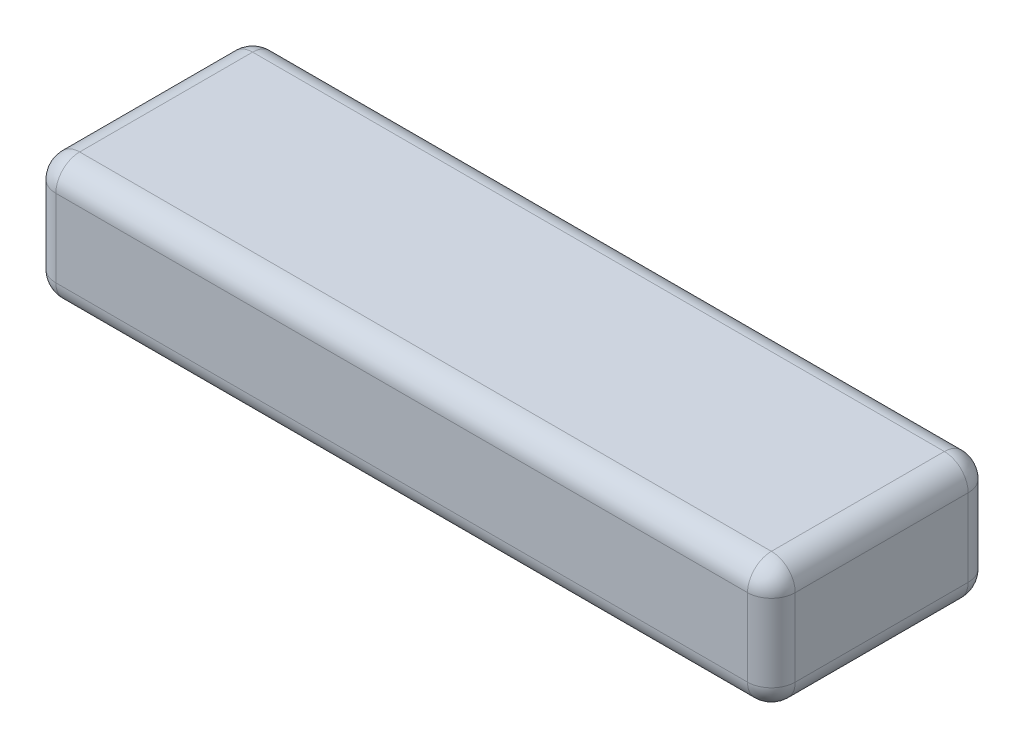
ISO-10303-21;
HEADER;
FILE_DESCRIPTION(('STEP AP214'),'2;1');
FILE_NAME('part.step','',(''),(''),'','','');
FILE_SCHEMA(('AUTOMOTIVE_DESIGN { 1 0 10303 214 1 1 1 1 }'));
ENDSEC;
DATA;
#1=APPLICATION_CONTEXT('core data for automotive mechanical design processes');
#2=APPLICATION_PROTOCOL_DEFINITION('international standard','automotive_design',2000,#1);
#3=PRODUCT_CONTEXT('',#1,'mechanical');
#4=PRODUCT('Part','Part','',(#3));
#5=PRODUCT_RELATED_PRODUCT_CATEGORY('part','',(#4));
#6=PRODUCT_DEFINITION_FORMATION('','',#4);
#7=PRODUCT_DEFINITION_CONTEXT('part definition',#1,'design');
#8=PRODUCT_DEFINITION('design','',#6,#7);
#9=PRODUCT_DEFINITION_SHAPE('','',#8);
#10=(LENGTH_UNIT() NAMED_UNIT(*) SI_UNIT(.MILLI.,.METRE.));
#11=(NAMED_UNIT(*) PLANE_ANGLE_UNIT() SI_UNIT($,.RADIAN.));
#12=(NAMED_UNIT(*) SI_UNIT($,.STERADIAN.) SOLID_ANGLE_UNIT());
#13=UNCERTAINTY_MEASURE_WITH_UNIT(LENGTH_MEASURE(1.E-05),#10,'distance_accuracy_value','');
#14=(GEOMETRIC_REPRESENTATION_CONTEXT(3) GLOBAL_UNCERTAINTY_ASSIGNED_CONTEXT((#13)) GLOBAL_UNIT_ASSIGNED_CONTEXT((#10,
#11,#12)) REPRESENTATION_CONTEXT('',''));
#15=CARTESIAN_POINT('',(0.,0.,0.));
#16=DIRECTION('',(0.,0.,1.));
#17=DIRECTION('',(1.,0.,0.));
#18=AXIS2_PLACEMENT_3D('',#15,#16,#17);
#19=CARTESIAN_POINT('',(31.,5.25,-9.25));
#20=DIRECTION('',(-1.,0.,0.));
#21=DIRECTION('',(0.,0.,1.));
#22=AXIS2_PLACEMENT_3D('',#19,#20,#21);
#23=PLANE('',#22);
#24=DIRECTION('',(0.,0.,-1.));
#25=VECTOR('',#24,1.);
#26=CARTESIAN_POINT('',(31.,-3.25,-9.25));
#27=LINE('',#26,#25);
#28=CARTESIAN_POINT('',(31.,-3.25,7.25));
#29=VERTEX_POINT('',#28);
#30=CARTESIAN_POINT('',(31.,-3.25,-7.25));
#31=VERTEX_POINT('',#30);
#32=EDGE_CURVE('E212',#29,#31,#27,.T.);
#33=ORIENTED_EDGE('',*,*,#32,.T.);
#34=DIRECTION('',(0.,-1.,0.));
#35=VECTOR('',#34,1.);
#36=CARTESIAN_POINT('',(31.,5.25,-7.25));
#37=LINE('',#36,#35);
#38=CARTESIAN_POINT('',(31.,3.25,-7.25));
#39=VERTEX_POINT('',#38);
#40=EDGE_CURVE('E216',#31,#39,#37,.F.);
#41=ORIENTED_EDGE('',*,*,#40,.T.);
#42=DIRECTION('',(0.,0.,-1.));
#43=VECTOR('',#42,1.);
#44=CARTESIAN_POINT('',(31.,3.25,9.25));
#45=LINE('',#44,#43);
#46=CARTESIAN_POINT('',(31.,3.25,7.25));
#47=VERTEX_POINT('',#46);
#48=EDGE_CURVE('E209',#39,#47,#45,.F.);
#49=ORIENTED_EDGE('',*,*,#48,.T.);
#50=DIRECTION('',(0.,-1.,0.));
#51=VECTOR('',#50,1.);
#52=CARTESIAN_POINT('',(31.,5.25,7.25));
#53=LINE('',#52,#51);
#54=EDGE_CURVE('E206',#47,#29,#53,.T.);
#55=ORIENTED_EDGE('',*,*,#54,.T.);
#56=EDGE_LOOP('',(#33,#41,#49,#55));
#57=FACE_BOUND('',#56,.T.);
#58=ADVANCED_FACE('F41',(#57),#23,.F.);
#59=CARTESIAN_POINT('',(-31.,5.25,-9.25));
#60=DIRECTION('',(0.,0.,1.));
#61=DIRECTION('',(1.,0.,0.));
#62=AXIS2_PLACEMENT_3D('',#59,#60,#61);
#63=PLANE('',#62);
#64=DIRECTION('',(-1.,0.,0.));
#65=VECTOR('',#64,1.);
#66=CARTESIAN_POINT('',(-31.,-3.25,-9.25));
#67=LINE('',#66,#65);
#68=CARTESIAN_POINT('',(29.,-3.25,-9.25));
#69=VERTEX_POINT('',#68);
#70=CARTESIAN_POINT('',(-29.,-3.25,-9.25));
#71=VERTEX_POINT('',#70);
#72=EDGE_CURVE('E143',#69,#71,#67,.T.);
#73=ORIENTED_EDGE('',*,*,#72,.T.);
#74=DIRECTION('',(0.,-1.,0.));
#75=VECTOR('',#74,1.);
#76=CARTESIAN_POINT('',(-29.,5.25,-9.25));
#77=LINE('',#76,#75);
#78=CARTESIAN_POINT('',(-29.,3.25,-9.25));
#79=VERTEX_POINT('',#78);
#80=EDGE_CURVE('E138',#71,#79,#77,.F.);
#81=ORIENTED_EDGE('',*,*,#80,.T.);
#82=DIRECTION('',(-1.,0.,0.));
#83=VECTOR('',#82,1.);
#84=CARTESIAN_POINT('',(31.,3.25,-9.25));
#85=LINE('',#84,#83);
#86=CARTESIAN_POINT('',(29.,3.25,-9.25));
#87=VERTEX_POINT('',#86);
#88=EDGE_CURVE('E130',#79,#87,#85,.F.);
#89=ORIENTED_EDGE('',*,*,#88,.T.);
#90=DIRECTION('',(0.,-1.,0.));
#91=VECTOR('',#90,1.);
#92=CARTESIAN_POINT('',(29.,5.25,-9.25));
#93=LINE('',#92,#91);
#94=EDGE_CURVE('E135',#87,#69,#93,.T.);
#95=ORIENTED_EDGE('',*,*,#94,.T.);
#96=EDGE_LOOP('',(#73,#81,#89,#95));
#97=FACE_BOUND('',#96,.T.);
#98=ADVANCED_FACE('F133',(#97),#63,.F.);
#99=CARTESIAN_POINT('',(-31.,5.25,-9.25));
#100=DIRECTION('',(1.,0.,0.));
#101=DIRECTION('',(0.,0.,-1.));
#102=AXIS2_PLACEMENT_3D('',#99,#100,#101);
#103=PLANE('',#102);
#104=DIRECTION('',(0.,0.,1.));
#105=VECTOR('',#104,1.);
#106=CARTESIAN_POINT('',(-31.,3.25,-9.25));
#107=LINE('',#106,#105);
#108=CARTESIAN_POINT('',(-31.,3.25,7.25));
#109=VERTEX_POINT('',#108);
#110=CARTESIAN_POINT('',(-31.,3.25,-7.25));
#111=VERTEX_POINT('',#110);
#112=EDGE_CURVE('E51',#109,#111,#107,.F.);
#113=ORIENTED_EDGE('',*,*,#112,.T.);
#114=DIRECTION('',(0.,-1.,0.));
#115=VECTOR('',#114,1.);
#116=CARTESIAN_POINT('',(-31.,5.25,-7.25));
#117=LINE('',#116,#115);
#118=CARTESIAN_POINT('',(-31.,-3.25,-7.25));
#119=VERTEX_POINT('',#118);
#120=EDGE_CURVE('E11',#111,#119,#117,.T.);
#121=ORIENTED_EDGE('',*,*,#120,.T.);
#122=DIRECTION('',(0.,0.,1.));
#123=VECTOR('',#122,1.);
#124=CARTESIAN_POINT('',(-31.,-3.25,-9.25));
#125=LINE('',#124,#123);
#126=CARTESIAN_POINT('',(-31.,-3.25,7.25));
#127=VERTEX_POINT('',#126);
#128=EDGE_CURVE('E231',#119,#127,#125,.T.);
#129=ORIENTED_EDGE('',*,*,#128,.T.);
#130=DIRECTION('',(0.,-1.,0.));
#131=VECTOR('',#130,1.);
#132=CARTESIAN_POINT('',(-31.,5.25,7.25));
#133=LINE('',#132,#131);
#134=EDGE_CURVE('E62',#127,#109,#133,.F.);
#135=ORIENTED_EDGE('',*,*,#134,.T.);
#136=EDGE_LOOP('',(#113,#121,#129,#135));
#137=FACE_BOUND('',#136,.T.);
#138=ADVANCED_FACE('F326',(#137),#103,.F.);
#139=CARTESIAN_POINT('',(-31.,5.25,9.25));
#140=DIRECTION('',(0.,0.,-1.));
#141=DIRECTION('',(-1.,0.,0.));
#142=AXIS2_PLACEMENT_3D('',#139,#140,#141);
#143=PLANE('',#142);
#144=DIRECTION('',(1.,0.,0.));
#145=VECTOR('',#144,1.);
#146=CARTESIAN_POINT('',(-31.,3.25,9.25));
#147=LINE('',#146,#145);
#148=CARTESIAN_POINT('',(29.,3.25,9.25));
#149=VERTEX_POINT('',#148);
#150=CARTESIAN_POINT('',(-29.,3.25,9.25));
#151=VERTEX_POINT('',#150);
#152=EDGE_CURVE('E196',#149,#151,#147,.F.);
#153=ORIENTED_EDGE('',*,*,#152,.T.);
#154=DIRECTION('',(0.,-1.,0.));
#155=VECTOR('',#154,1.);
#156=CARTESIAN_POINT('',(-29.,5.25,9.25));
#157=LINE('',#156,#155);
#158=CARTESIAN_POINT('',(-29.,-3.25,9.25));
#159=VERTEX_POINT('',#158);
#160=EDGE_CURVE('E203',#151,#159,#157,.T.);
#161=ORIENTED_EDGE('',*,*,#160,.T.);
#162=DIRECTION('',(1.,0.,0.));
#163=VECTOR('',#162,1.);
#164=CARTESIAN_POINT('',(-31.,-3.25,9.25));
#165=LINE('',#164,#163);
#166=CARTESIAN_POINT('',(29.,-3.25,9.25));
#167=VERTEX_POINT('',#166);
#168=EDGE_CURVE('E199',#159,#167,#165,.T.);
#169=ORIENTED_EDGE('',*,*,#168,.T.);
#170=DIRECTION('',(0.,-1.,0.));
#171=VECTOR('',#170,1.);
#172=CARTESIAN_POINT('',(29.,5.25,9.25));
#173=LINE('',#172,#171);
#174=EDGE_CURVE('E193',#167,#149,#173,.F.);
#175=ORIENTED_EDGE('',*,*,#174,.T.);
#176=EDGE_LOOP('',(#153,#161,#169,#175));
#177=FACE_BOUND('',#176,.T.);
#178=ADVANCED_FACE('F349',(#177),#143,.F.);
#179=CARTESIAN_POINT('',(0.,5.25,0.));
#180=DIRECTION('',(0.,1.,0.));
#181=DIRECTION('',(0.,0.,1.));
#182=AXIS2_PLACEMENT_3D('',#179,#180,#181);
#183=PLANE('',#182);
#184=DIRECTION('',(1.,0.,0.));
#185=VECTOR('',#184,1.);
#186=CARTESIAN_POINT('',(31.,5.25,7.25));
#187=LINE('',#186,#185);
#188=CARTESIAN_POINT('',(-29.,5.25,7.25));
#189=VERTEX_POINT('',#188);
#190=CARTESIAN_POINT('',(29.,5.25,7.25));
#191=VERTEX_POINT('',#190);
#192=EDGE_CURVE('E224',#189,#191,#187,.T.);
#193=ORIENTED_EDGE('',*,*,#192,.T.);
#194=DIRECTION('',(0.,0.,-1.));
#195=VECTOR('',#194,1.);
#196=CARTESIAN_POINT('',(29.,5.25,-9.25));
#197=LINE('',#196,#195);
#198=CARTESIAN_POINT('',(29.,5.25,-7.25));
#199=VERTEX_POINT('',#198);
#200=EDGE_CURVE('E228',#191,#199,#197,.T.);
#201=ORIENTED_EDGE('',*,*,#200,.T.);
#202=DIRECTION('',(-1.,0.,0.));
#203=VECTOR('',#202,1.);
#204=CARTESIAN_POINT('',(-31.,5.25,-7.25));
#205=LINE('',#204,#203);
#206=CARTESIAN_POINT('',(-29.,5.25,-7.25));
#207=VERTEX_POINT('',#206);
#208=EDGE_CURVE('E150',#199,#207,#205,.T.);
#209=ORIENTED_EDGE('',*,*,#208,.T.);
#210=DIRECTION('',(0.,0.,1.));
#211=VECTOR('',#210,1.);
#212=CARTESIAN_POINT('',(-29.,5.25,9.25));
#213=LINE('',#212,#211);
#214=EDGE_CURVE('E219',#207,#189,#213,.T.);
#215=ORIENTED_EDGE('',*,*,#214,.T.);
#216=EDGE_LOOP('',(#193,#201,#209,#215));
#217=FACE_BOUND('',#216,.T.);
#218=ADVANCED_FACE('F366',(#217),#183,.T.);
#219=CARTESIAN_POINT('',(0.,-5.25,0.));
#220=DIRECTION('',(0.,1.,0.));
#221=DIRECTION('',(0.,0.,1.));
#222=AXIS2_PLACEMENT_3D('',#219,#220,#221);
#223=PLANE('',#222);
#224=DIRECTION('',(-1.,0.,0.));
#225=VECTOR('',#224,1.);
#226=CARTESIAN_POINT('',(0.,-5.25,-7.25));
#227=LINE('',#226,#225);
#228=CARTESIAN_POINT('',(-29.,-5.25,-7.25));
#229=VERTEX_POINT('',#228);
#230=CARTESIAN_POINT('',(29.,-5.25,-7.25));
#231=VERTEX_POINT('',#230);
#232=EDGE_CURVE('E186',#229,#231,#227,.F.);
#233=ORIENTED_EDGE('',*,*,#232,.T.);
#234=DIRECTION('',(0.,0.,-1.));
#235=VECTOR('',#234,1.);
#236=CARTESIAN_POINT('',(29.,-5.25,0.));
#237=LINE('',#236,#235);
#238=CARTESIAN_POINT('',(29.,-5.25,7.25));
#239=VERTEX_POINT('',#238);
#240=EDGE_CURVE('E190',#231,#239,#237,.F.);
#241=ORIENTED_EDGE('',*,*,#240,.T.);
#242=DIRECTION('',(1.,0.,0.));
#243=VECTOR('',#242,1.);
#244=CARTESIAN_POINT('',(0.,-5.25,7.25));
#245=LINE('',#244,#243);
#246=CARTESIAN_POINT('',(-29.,-5.25,7.25));
#247=VERTEX_POINT('',#246);
#248=EDGE_CURVE('E183',#239,#247,#245,.F.);
#249=ORIENTED_EDGE('',*,*,#248,.T.);
#250=DIRECTION('',(0.,0.,1.));
#251=VECTOR('',#250,1.);
#252=CARTESIAN_POINT('',(-29.,-5.25,0.));
#253=LINE('',#252,#251);
#254=EDGE_CURVE('E180',#247,#229,#253,.F.);
#255=ORIENTED_EDGE('',*,*,#254,.T.);
#256=EDGE_LOOP('',(#233,#241,#249,#255));
#257=FACE_BOUND('',#256,.T.);
#258=ADVANCED_FACE('F340',(#257),#223,.F.);
#259=CARTESIAN_POINT('',(0.,3.25,7.25));
#260=DIRECTION('',(-1.,0.,0.));
#261=DIRECTION('',(0.,0.,1.));
#262=AXIS2_PLACEMENT_3D('',#259,#260,#261);
#263=CYLINDRICAL_SURFACE('',#262,2.);
#264=CARTESIAN_POINT('',(29.,3.25,7.25));
#265=DIRECTION('',(1.,0.,0.));
#266=DIRECTION('',(0.,0.,-1.));
#267=AXIS2_PLACEMENT_3D('',#264,#265,#266);
#268=CIRCLE('',#267,2.);
#269=EDGE_CURVE('E45',#191,#149,#268,.T.);
#270=ORIENTED_EDGE('',*,*,#269,.F.);
#271=ORIENTED_EDGE('',*,*,#192,.F.);
#272=CARTESIAN_POINT('',(-29.,3.25,7.25));
#273=DIRECTION('',(-1.,0.,0.));
#274=DIRECTION('',(0.,0.,1.));
#275=AXIS2_PLACEMENT_3D('',#272,#273,#274);
#276=CIRCLE('',#275,2.);
#277=EDGE_CURVE('E174',#151,#189,#276,.T.);
#278=ORIENTED_EDGE('',*,*,#277,.F.);
#279=ORIENTED_EDGE('',*,*,#152,.F.);
#280=EDGE_LOOP('',(#270,#271,#278,#279));
#281=FACE_BOUND('',#280,.T.);
#282=ADVANCED_FACE('F43',(#281),#263,.T.);
#283=CARTESIAN_POINT('',(29.,3.25,7.25));
#284=DIRECTION('',(0.,0.,1.));
#285=DIRECTION('',(1.,0.,0.));
#286=AXIS2_PLACEMENT_3D('',#283,#284,#285);
#287=SPHERICAL_SURFACE('',#286,2.);
#288=CARTESIAN_POINT('',(29.,3.25,7.25));
#289=DIRECTION('',(0.,0.,1.));
#290=DIRECTION('',(0.,-1.,0.));
#291=AXIS2_PLACEMENT_3D('',#288,#289,#290);
#292=CIRCLE('',#291,2.);
#293=EDGE_CURVE('E297',#191,#47,#292,.F.);
#294=ORIENTED_EDGE('',*,*,#293,.F.);
#295=ORIENTED_EDGE('',*,*,#269,.T.);
#296=CARTESIAN_POINT('',(29.,3.25,7.25));
#297=DIRECTION('',(0.,1.,0.));
#298=DIRECTION('',(0.,0.,1.));
#299=AXIS2_PLACEMENT_3D('',#296,#297,#298);
#300=CIRCLE('',#299,2.);
#301=EDGE_CURVE('E301',#47,#149,#300,.F.);
#302=ORIENTED_EDGE('',*,*,#301,.F.);
#303=EDGE_LOOP('',(#294,#295,#302));
#304=FACE_BOUND('',#303,.T.);
#305=ADVANCED_FACE('F354',(#304),#287,.T.);
#306=CARTESIAN_POINT('',(-29.,3.25,7.25));
#307=DIRECTION('',(0.,0.,1.));
#308=DIRECTION('',(1.,0.,0.));
#309=AXIS2_PLACEMENT_3D('',#306,#307,#308);
#310=SPHERICAL_SURFACE('',#309,2.);
#311=CARTESIAN_POINT('',(-29.,3.25,7.25));
#312=DIRECTION('',(0.,1.,0.));
#313=DIRECTION('',(0.,0.,1.));
#314=AXIS2_PLACEMENT_3D('',#311,#312,#313);
#315=CIRCLE('',#314,2.);
#316=EDGE_CURVE('E290',#151,#109,#315,.F.);
#317=ORIENTED_EDGE('',*,*,#316,.F.);
#318=ORIENTED_EDGE('',*,*,#277,.T.);
#319=CARTESIAN_POINT('',(-29.,3.25,7.25));
#320=DIRECTION('',(0.,0.,1.));
#321=DIRECTION('',(1.,0.,0.));
#322=AXIS2_PLACEMENT_3D('',#319,#320,#321);
#323=CIRCLE('',#322,2.);
#324=EDGE_CURVE('E293',#109,#189,#323,.F.);
#325=ORIENTED_EDGE('',*,*,#324,.F.);
#326=EDGE_LOOP('',(#317,#318,#325));
#327=FACE_BOUND('',#326,.T.);
#328=ADVANCED_FACE('F310',(#327),#310,.T.);
#329=CARTESIAN_POINT('',(29.,5.25,7.25));
#330=DIRECTION('',(0.,-1.,0.));
#331=DIRECTION('',(0.,0.,-1.));
#332=AXIS2_PLACEMENT_3D('',#329,#330,#331);
#333=CYLINDRICAL_SURFACE('',#332,2.);
#334=ORIENTED_EDGE('',*,*,#301,.T.);
#335=ORIENTED_EDGE('',*,*,#174,.F.);
#336=CARTESIAN_POINT('',(29.,-3.25,7.25));
#337=DIRECTION('',(0.,-1.,0.));
#338=DIRECTION('',(0.,0.,-1.));
#339=AXIS2_PLACEMENT_3D('',#336,#337,#338);
#340=CIRCLE('',#339,2.);
#341=EDGE_CURVE('E283',#29,#167,#340,.T.);
#342=ORIENTED_EDGE('',*,*,#341,.F.);
#343=ORIENTED_EDGE('',*,*,#54,.F.);
#344=EDGE_LOOP('',(#334,#335,#342,#343));
#345=FACE_BOUND('',#344,.T.);
#346=ADVANCED_FACE('F357',(#345),#333,.T.);
#347=CARTESIAN_POINT('',(29.,3.25,0.));
#348=DIRECTION('',(0.,0.,1.));
#349=DIRECTION('',(1.,0.,0.));
#350=AXIS2_PLACEMENT_3D('',#347,#348,#349);
#351=CYLINDRICAL_SURFACE('',#350,2.);
#352=ORIENTED_EDGE('',*,*,#293,.T.);
#353=ORIENTED_EDGE('',*,*,#48,.F.);
#354=CARTESIAN_POINT('',(29.,3.25,-7.25));
#355=DIRECTION('',(0.,0.,-1.));
#356=DIRECTION('',(-1.,0.,0.));
#357=AXIS2_PLACEMENT_3D('',#354,#355,#356);
#358=CIRCLE('',#357,2.);
#359=EDGE_CURVE('E155',#199,#39,#358,.T.);
#360=ORIENTED_EDGE('',*,*,#359,.F.);
#361=ORIENTED_EDGE('',*,*,#200,.F.);
#362=EDGE_LOOP('',(#352,#353,#360,#361));
#363=FACE_BOUND('',#362,.T.);
#364=ADVANCED_FACE('F364',(#363),#351,.T.);
#365=CARTESIAN_POINT('',(0.,3.25,-7.25));
#366=DIRECTION('',(1.,0.,0.));
#367=DIRECTION('',(0.,0.,-1.));
#368=AXIS2_PLACEMENT_3D('',#365,#366,#367);
#369=CYLINDRICAL_SURFACE('',#368,2.);
#370=CARTESIAN_POINT('',(-29.,3.25,-7.25));
#371=DIRECTION('',(-1.,0.,0.));
#372=DIRECTION('',(0.,0.,1.));
#373=AXIS2_PLACEMENT_3D('',#370,#371,#372);
#374=CIRCLE('',#373,2.);
#375=EDGE_CURVE('E156',#207,#79,#374,.T.);
#376=ORIENTED_EDGE('',*,*,#375,.F.);
#377=ORIENTED_EDGE('',*,*,#208,.F.);
#378=CARTESIAN_POINT('',(29.,3.25,-7.25));
#379=DIRECTION('',(1.,0.,0.));
#380=DIRECTION('',(0.,0.,-1.));
#381=AXIS2_PLACEMENT_3D('',#378,#379,#380);
#382=CIRCLE('',#381,2.);
#383=EDGE_CURVE('E147',#87,#199,#382,.T.);
#384=ORIENTED_EDGE('',*,*,#383,.F.);
#385=ORIENTED_EDGE('',*,*,#88,.F.);
#386=EDGE_LOOP('',(#376,#377,#384,#385));
#387=FACE_BOUND('',#386,.T.);
#388=ADVANCED_FACE('F149',(#387),#369,.T.);
#389=CARTESIAN_POINT('',(-29.,3.25,0.));
#390=DIRECTION('',(0.,0.,-1.));
#391=DIRECTION('',(-1.,0.,0.));
#392=AXIS2_PLACEMENT_3D('',#389,#390,#391);
#393=CYLINDRICAL_SURFACE('',#392,2.);
#394=ORIENTED_EDGE('',*,*,#324,.T.);
#395=ORIENTED_EDGE('',*,*,#214,.F.);
#396=CARTESIAN_POINT('',(-29.,3.25,-7.25));
#397=DIRECTION('',(0.,0.,-1.));
#398=DIRECTION('',(-1.,0.,0.));
#399=AXIS2_PLACEMENT_3D('',#396,#397,#398);
#400=CIRCLE('',#399,2.);
#401=EDGE_CURVE('E275',#111,#207,#400,.T.);
#402=ORIENTED_EDGE('',*,*,#401,.F.);
#403=ORIENTED_EDGE('',*,*,#112,.F.);
#404=EDGE_LOOP('',(#394,#395,#402,#403));
#405=FACE_BOUND('',#404,.T.);
#406=ADVANCED_FACE('F317',(#405),#393,.T.);
#407=CARTESIAN_POINT('',(-29.,5.25,7.25));
#408=DIRECTION('',(0.,-1.,0.));
#409=DIRECTION('',(0.,0.,-1.));
#410=AXIS2_PLACEMENT_3D('',#407,#408,#409);
#411=CYLINDRICAL_SURFACE('',#410,2.);
#412=ORIENTED_EDGE('',*,*,#316,.T.);
#413=ORIENTED_EDGE('',*,*,#134,.F.);
#414=CARTESIAN_POINT('',(-29.,-3.25,7.25));
#415=DIRECTION('',(0.,-1.,0.));
#416=DIRECTION('',(0.,0.,-1.));
#417=AXIS2_PLACEMENT_3D('',#414,#415,#416);
#418=CIRCLE('',#417,2.);
#419=EDGE_CURVE('E271',#159,#127,#418,.T.);
#420=ORIENTED_EDGE('',*,*,#419,.F.);
#421=ORIENTED_EDGE('',*,*,#160,.F.);
#422=EDGE_LOOP('',(#412,#413,#420,#421));
#423=FACE_BOUND('',#422,.T.);
#424=ADVANCED_FACE('F331',(#423),#411,.T.);
#425=CARTESIAN_POINT('',(-31.,-3.25,7.25));
#426=DIRECTION('',(1.,0.,0.));
#427=DIRECTION('',(0.,0.,-1.));
#428=AXIS2_PLACEMENT_3D('',#425,#426,#427);
#429=CYLINDRICAL_SURFACE('',#428,2.);
#430=CARTESIAN_POINT('',(29.,-3.25,7.25));
#431=DIRECTION('',(1.,0.,0.));
#432=DIRECTION('',(0.,0.,-1.));
#433=AXIS2_PLACEMENT_3D('',#430,#431,#432);
#434=CIRCLE('',#433,2.);
#435=EDGE_CURVE('E286',#167,#239,#434,.T.);
#436=ORIENTED_EDGE('',*,*,#435,.F.);
#437=ORIENTED_EDGE('',*,*,#168,.F.);
#438=CARTESIAN_POINT('',(-29.,-3.25,7.25));
#439=DIRECTION('',(-1.,0.,0.));
#440=DIRECTION('',(0.,0.,1.));
#441=AXIS2_PLACEMENT_3D('',#438,#439,#440);
#442=CIRCLE('',#441,2.);
#443=EDGE_CURVE('E267',#247,#159,#442,.T.);
#444=ORIENTED_EDGE('',*,*,#443,.F.);
#445=ORIENTED_EDGE('',*,*,#248,.F.);
#446=EDGE_LOOP('',(#436,#437,#444,#445));
#447=FACE_BOUND('',#446,.T.);
#448=ADVANCED_FACE('F346',(#447),#429,.T.);
#449=CARTESIAN_POINT('',(29.,-3.25,7.25));
#450=DIRECTION('',(0.,0.,1.));
#451=DIRECTION('',(1.,0.,0.));
#452=AXIS2_PLACEMENT_3D('',#449,#450,#451);
#453=SPHERICAL_SURFACE('',#452,2.);
#454=ORIENTED_EDGE('',*,*,#341,.T.);
#455=ORIENTED_EDGE('',*,*,#435,.T.);
#456=CARTESIAN_POINT('',(29.,-3.25,7.25));
#457=DIRECTION('',(0.,0.,1.));
#458=DIRECTION('',(1.,0.,0.));
#459=AXIS2_PLACEMENT_3D('',#456,#457,#458);
#460=CIRCLE('',#459,2.);
#461=EDGE_CURVE('E164',#29,#239,#460,.F.);
#462=ORIENTED_EDGE('',*,*,#461,.F.);
#463=EDGE_LOOP('',(#454,#455,#462));
#464=FACE_BOUND('',#463,.T.);
#465=ADVANCED_FACE('F411',(#464),#453,.T.);
#466=CARTESIAN_POINT('',(29.,3.25,-7.25));
#467=DIRECTION('',(0.,0.,1.));
#468=DIRECTION('',(1.,0.,0.));
#469=AXIS2_PLACEMENT_3D('',#466,#467,#468);
#470=SPHERICAL_SURFACE('',#469,2.);
#471=ORIENTED_EDGE('',*,*,#383,.T.);
#472=ORIENTED_EDGE('',*,*,#359,.T.);
#473=CARTESIAN_POINT('',(29.,3.25,-7.25));
#474=DIRECTION('',(0.,1.,0.));
#475=DIRECTION('',(0.,0.,1.));
#476=AXIS2_PLACEMENT_3D('',#473,#474,#475);
#477=CIRCLE('',#476,2.);
#478=EDGE_CURVE('E159',#87,#39,#477,.F.);
#479=ORIENTED_EDGE('',*,*,#478,.F.);
#480=EDGE_LOOP('',(#471,#472,#479));
#481=FACE_BOUND('',#480,.T.);
#482=ADVANCED_FACE('F160',(#481),#470,.T.);
#483=CARTESIAN_POINT('',(-29.,3.25,-7.25));
#484=DIRECTION('',(0.,0.,1.));
#485=DIRECTION('',(1.,0.,0.));
#486=AXIS2_PLACEMENT_3D('',#483,#484,#485);
#487=SPHERICAL_SURFACE('',#486,2.);
#488=ORIENTED_EDGE('',*,*,#401,.T.);
#489=ORIENTED_EDGE('',*,*,#375,.T.);
#490=CARTESIAN_POINT('',(-29.,3.25,-7.25));
#491=DIRECTION('',(0.,1.,0.));
#492=DIRECTION('',(0.,0.,1.));
#493=AXIS2_PLACEMENT_3D('',#490,#491,#492);
#494=CIRCLE('',#493,2.);
#495=EDGE_CURVE('E165',#111,#79,#494,.F.);
#496=ORIENTED_EDGE('',*,*,#495,.F.);
#497=EDGE_LOOP('',(#488,#489,#496));
#498=FACE_BOUND('',#497,.T.);
#499=ADVANCED_FACE('F321',(#498),#487,.T.);
#500=CARTESIAN_POINT('',(-29.,-3.25,7.25));
#501=DIRECTION('',(0.,0.,1.));
#502=DIRECTION('',(1.,0.,0.));
#503=AXIS2_PLACEMENT_3D('',#500,#501,#502);
#504=SPHERICAL_SURFACE('',#503,2.);
#505=ORIENTED_EDGE('',*,*,#443,.T.);
#506=ORIENTED_EDGE('',*,*,#419,.T.);
#507=CARTESIAN_POINT('',(-29.,-3.25,7.25));
#508=DIRECTION('',(0.,0.,1.));
#509=DIRECTION('',(1.,0.,0.));
#510=AXIS2_PLACEMENT_3D('',#507,#508,#509);
#511=CIRCLE('',#510,2.);
#512=EDGE_CURVE('E257',#247,#127,#511,.F.);
#513=ORIENTED_EDGE('',*,*,#512,.F.);
#514=EDGE_LOOP('',(#505,#506,#513));
#515=FACE_BOUND('',#514,.T.);
#516=ADVANCED_FACE('F334',(#515),#504,.T.);
#517=CARTESIAN_POINT('',(29.,-3.25,-9.25));
#518=DIRECTION('',(0.,0.,-1.));
#519=DIRECTION('',(-1.,0.,0.));
#520=AXIS2_PLACEMENT_3D('',#517,#518,#519);
#521=CYLINDRICAL_SURFACE('',#520,2.);
#522=ORIENTED_EDGE('',*,*,#461,.T.);
#523=ORIENTED_EDGE('',*,*,#240,.F.);
#524=CARTESIAN_POINT('',(29.,-3.25,-7.25));
#525=DIRECTION('',(0.,0.,-1.));
#526=DIRECTION('',(-1.,0.,0.));
#527=AXIS2_PLACEMENT_3D('',#524,#525,#526);
#528=CIRCLE('',#527,2.);
#529=EDGE_CURVE('E253',#31,#231,#528,.T.);
#530=ORIENTED_EDGE('',*,*,#529,.F.);
#531=ORIENTED_EDGE('',*,*,#32,.F.);
#532=EDGE_LOOP('',(#522,#523,#530,#531));
#533=FACE_BOUND('',#532,.T.);
#534=ADVANCED_FACE('F401',(#533),#521,.T.);
#535=CARTESIAN_POINT('',(29.,5.25,-7.25));
#536=DIRECTION('',(0.,-1.,0.));
#537=DIRECTION('',(0.,0.,-1.));
#538=AXIS2_PLACEMENT_3D('',#535,#536,#537);
#539=CYLINDRICAL_SURFACE('',#538,2.);
#540=ORIENTED_EDGE('',*,*,#478,.T.);
#541=ORIENTED_EDGE('',*,*,#40,.F.);
#542=CARTESIAN_POINT('',(29.,-3.25,-7.25));
#543=DIRECTION('',(0.,-1.,0.));
#544=DIRECTION('',(0.,0.,-1.));
#545=AXIS2_PLACEMENT_3D('',#542,#543,#544);
#546=CIRCLE('',#545,2.);
#547=EDGE_CURVE('E168',#69,#31,#546,.T.);
#548=ORIENTED_EDGE('',*,*,#547,.F.);
#549=ORIENTED_EDGE('',*,*,#94,.F.);
#550=EDGE_LOOP('',(#540,#541,#548,#549));
#551=FACE_BOUND('',#550,.T.);
#552=ADVANCED_FACE('F167',(#551),#539,.T.);
#553=CARTESIAN_POINT('',(-29.,5.25,-7.25));
#554=DIRECTION('',(0.,-1.,0.));
#555=DIRECTION('',(0.,0.,-1.));
#556=AXIS2_PLACEMENT_3D('',#553,#554,#555);
#557=CYLINDRICAL_SURFACE('',#556,2.);
#558=ORIENTED_EDGE('',*,*,#495,.T.);
#559=ORIENTED_EDGE('',*,*,#80,.F.);
#560=CARTESIAN_POINT('',(-29.,-3.25,-7.25));
#561=DIRECTION('',(0.,-1.,0.));
#562=DIRECTION('',(0.,0.,-1.));
#563=AXIS2_PLACEMENT_3D('',#560,#561,#562);
#564=CIRCLE('',#563,2.);
#565=EDGE_CURVE('E247',#119,#71,#564,.T.);
#566=ORIENTED_EDGE('',*,*,#565,.F.);
#567=ORIENTED_EDGE('',*,*,#120,.F.);
#568=EDGE_LOOP('',(#558,#559,#566,#567));
#569=FACE_BOUND('',#568,.T.);
#570=ADVANCED_FACE('F324',(#569),#557,.T.);
#571=CARTESIAN_POINT('',(-29.,-3.25,-9.25));
#572=DIRECTION('',(0.,0.,1.));
#573=DIRECTION('',(1.,0.,0.));
#574=AXIS2_PLACEMENT_3D('',#571,#572,#573);
#575=CYLINDRICAL_SURFACE('',#574,2.);
#576=ORIENTED_EDGE('',*,*,#512,.T.);
#577=ORIENTED_EDGE('',*,*,#128,.F.);
#578=CARTESIAN_POINT('',(-29.,-3.25,-7.25));
#579=DIRECTION('',(0.,0.,-1.));
#580=DIRECTION('',(-1.,0.,0.));
#581=AXIS2_PLACEMENT_3D('',#578,#579,#580);
#582=CIRCLE('',#581,2.);
#583=EDGE_CURVE('E244',#229,#119,#582,.T.);
#584=ORIENTED_EDGE('',*,*,#583,.F.);
#585=ORIENTED_EDGE('',*,*,#254,.F.);
#586=EDGE_LOOP('',(#576,#577,#584,#585));
#587=FACE_BOUND('',#586,.T.);
#588=ADVANCED_FACE('F337',(#587),#575,.T.);
#589=CARTESIAN_POINT('',(29.,-3.25,-7.25));
#590=DIRECTION('',(0.,0.,1.));
#591=DIRECTION('',(1.,0.,0.));
#592=AXIS2_PLACEMENT_3D('',#589,#590,#591);
#593=SPHERICAL_SURFACE('',#592,2.);
#594=ORIENTED_EDGE('',*,*,#547,.T.);
#595=ORIENTED_EDGE('',*,*,#529,.T.);
#596=CARTESIAN_POINT('',(29.,-3.25,-7.25));
#597=DIRECTION('',(1.,0.,0.));
#598=DIRECTION('',(0.,0.,-1.));
#599=AXIS2_PLACEMENT_3D('',#596,#597,#598);
#600=CIRCLE('',#599,2.);
#601=EDGE_CURVE('E241',#69,#231,#600,.F.);
#602=ORIENTED_EDGE('',*,*,#601,.F.);
#603=EDGE_LOOP('',(#594,#595,#602));
#604=FACE_BOUND('',#603,.T.);
#605=ADVANCED_FACE('F390',(#604),#593,.T.);
#606=CARTESIAN_POINT('',(-29.,-3.25,-7.25));
#607=DIRECTION('',(0.,0.,1.));
#608=DIRECTION('',(1.,0.,0.));
#609=AXIS2_PLACEMENT_3D('',#606,#607,#608);
#610=SPHERICAL_SURFACE('',#609,2.);
#611=ORIENTED_EDGE('',*,*,#583,.T.);
#612=ORIENTED_EDGE('',*,*,#565,.T.);
#613=CARTESIAN_POINT('',(-29.,-3.25,-7.25));
#614=DIRECTION('',(-1.,0.,0.));
#615=DIRECTION('',(0.,0.,1.));
#616=AXIS2_PLACEMENT_3D('',#613,#614,#615);
#617=CIRCLE('',#616,2.);
#618=EDGE_CURVE('E238',#229,#71,#617,.F.);
#619=ORIENTED_EDGE('',*,*,#618,.F.);
#620=EDGE_LOOP('',(#611,#612,#619));
#621=FACE_BOUND('',#620,.T.);
#622=ADVANCED_FACE('F386',(#621),#610,.T.);
#623=CARTESIAN_POINT('',(-31.,-3.25,-7.25));
#624=DIRECTION('',(-1.,0.,0.));
#625=DIRECTION('',(0.,0.,1.));
#626=AXIS2_PLACEMENT_3D('',#623,#624,#625);
#627=CYLINDRICAL_SURFACE('',#626,2.);
#628=ORIENTED_EDGE('',*,*,#601,.T.);
#629=ORIENTED_EDGE('',*,*,#232,.F.);
#630=ORIENTED_EDGE('',*,*,#618,.T.);
#631=ORIENTED_EDGE('',*,*,#72,.F.);
#632=EDGE_LOOP('',(#628,#629,#630,#631));
#633=FACE_BOUND('',#632,.T.);
#634=ADVANCED_FACE('F383',(#633),#627,.T.);
#635=CLOSED_SHELL('',(#58,#98,#138,#178,#218,#258,#282,#305,#328,#346,#364,#388,#406,#424,#448,
#465,#482,#499,#516,#534,#552,#570,#588,#605,#622,#634));
#636=MANIFOLD_SOLID_BREP('B2',#635);
#637=ADVANCED_BREP_SHAPE_REPRESENTATION('',(#18,#636),#14);
#638=SHAPE_DEFINITION_REPRESENTATION(#9,#637);
ENDSEC;
END-ISO-10303-21;
